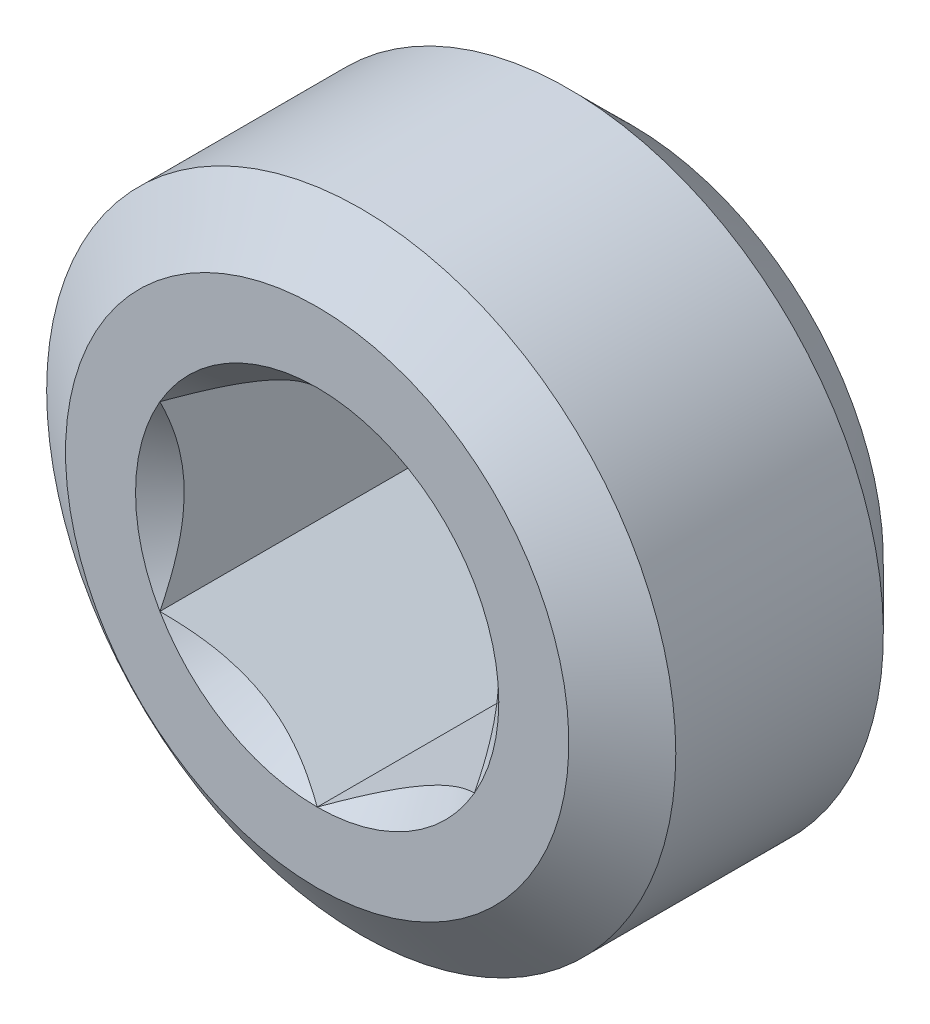
ISO-10303-21;
HEADER;
FILE_DESCRIPTION(('STEP AP214'),'2;1');
FILE_NAME('part.step','',(''),(''),'','','');
FILE_SCHEMA(('AUTOMOTIVE_DESIGN { 1 0 10303 214 1 1 1 1 }'));
ENDSEC;
DATA;
#1=APPLICATION_CONTEXT('core data for automotive mechanical design processes');
#2=APPLICATION_PROTOCOL_DEFINITION('international standard','automotive_design',2000,#1);
#3=PRODUCT_CONTEXT('',#1,'mechanical');
#4=PRODUCT('Part','Part','',(#3));
#5=PRODUCT_RELATED_PRODUCT_CATEGORY('part','',(#4));
#6=PRODUCT_DEFINITION_FORMATION('','',#4);
#7=PRODUCT_DEFINITION_CONTEXT('part definition',#1,'design');
#8=PRODUCT_DEFINITION('design','',#6,#7);
#9=PRODUCT_DEFINITION_SHAPE('','',#8);
#10=(LENGTH_UNIT() NAMED_UNIT(*) SI_UNIT(.MILLI.,.METRE.));
#11=(NAMED_UNIT(*) PLANE_ANGLE_UNIT() SI_UNIT($,.RADIAN.));
#12=(NAMED_UNIT(*) SI_UNIT($,.STERADIAN.) SOLID_ANGLE_UNIT());
#13=UNCERTAINTY_MEASURE_WITH_UNIT(LENGTH_MEASURE(1.E-05),#10,'distance_accuracy_value','');
#14=(GEOMETRIC_REPRESENTATION_CONTEXT(3) GLOBAL_UNCERTAINTY_ASSIGNED_CONTEXT((#13)) GLOBAL_UNIT_ASSIGNED_CONTEXT((#10,
#11,#12)) REPRESENTATION_CONTEXT('',''));
#15=CARTESIAN_POINT('',(0.,0.,0.));
#16=DIRECTION('',(0.,0.,1.));
#17=DIRECTION('',(1.,0.,0.));
#18=AXIS2_PLACEMENT_3D('',#15,#16,#17);
#19=CARTESIAN_POINT('',(-26.7001511278113,2.25730091694708,9.72285659624124));
#20=DIRECTION('',(0.5,-0.866025403784439,0.));
#21=DIRECTION('',(0.866025403784439,0.5,0.));
#22=AXIS2_PLACEMENT_3D('',#19,#20,#21);
#23=PLANE('',#22);
#24=CARTESIAN_POINT('',(-26.7001511278299,2.25730091693024,12.8978565962272));
#25=CARTESIAN_POINT('',(-26.6455879775564,2.28880296643238,12.8663847785851));
#26=CARTESIAN_POINT('',(-26.5901125302342,2.32083173087885,12.836761659007));
#27=CARTESIAN_POINT('',(-26.4769924001289,2.38614166844709,12.782522991681));
#28=CARTESIAN_POINT('',(-26.4193369654938,2.41942904915349,12.7579376124487));
#29=CARTESIAN_POINT('',(-26.3030776097173,2.48655141950653,12.7158226923412));
#30=CARTESIAN_POINT('',(-26.2445032803684,2.52036932432384,12.698187325774));
#31=CARTESIAN_POINT('',(-26.1260654656066,2.58874942855891,12.6710166849103));
#32=CARTESIAN_POINT('',(-26.0662055956986,2.62330954056393,12.6614611363602));
#33=CARTESIAN_POINT('',(-25.9630343536465,2.68287548493528,12.652839338127));
#34=CARTESIAN_POINT('',(-25.9198561754726,2.70780441772711,12.6515634180169));
#35=CARTESIAN_POINT('',(-25.8335704619126,2.75762149767819,12.6537157340965));
#36=CARTESIAN_POINT('',(-25.7904629565889,2.78250962748097,12.6571456191349));
#37=CARTESIAN_POINT('',(-25.7046659277156,2.83204456519659,12.6685129104493));
#38=CARTESIAN_POINT('',(-25.6619767983377,2.85669114553441,12.6764542164838));
#39=CARTESIAN_POINT('',(-25.5773150768888,2.90557061320299,12.6964128731102));
#40=CARTESIAN_POINT('',(-25.5353428003856,2.92980331834058,12.7084319725752));
#41=CARTESIAN_POINT('',(-25.4278758481489,2.99184939214346,12.7441004281705));
#42=CARTESIAN_POINT('',(-25.363046571638,3.02927859238842,12.7704343038184));
#43=CARTESIAN_POINT('',(-25.2677222434358,3.08431411893625,12.8148872108213));
#44=CARTESIAN_POINT('',(-25.2363099178139,3.10245003358992,12.8305049555352));
#45=CARTESIAN_POINT('',(-25.174062645343,3.13838851310735,12.8631660468058));
#46=CARTESIAN_POINT('',(-25.1432274322107,3.15619123170977,12.8802087150041));
#47=CARTESIAN_POINT('',(-25.1126511277906,3.17384446929754,12.8978565962298));
#48=B_SPLINE_CURVE_WITH_KNOTS('',3,(#24,#25,#26,#27,#28,#29,#30,#31,#32,#33,#34,#35,#36,#37,#38,
#39,#40,#41,#42,#43,#44,#45,#46,#47),.UNSPECIFIED.,.F.,.F.,(4,2,2,2,2,2,2,2,2,2,2,4),(0.,
0.211427927735293,0.424087197154886,0.633370156432808,0.842126401529719,0.991537201113437,
1.14100036553609,1.29059292578889,1.44024972416641,1.67781721418784,1.7962706941292,
1.91466809997211),.UNSPECIFIED.);
#49=CARTESIAN_POINT('',(-26.7001511278455,2.25730091691561,12.8978565962493));
#50=VERTEX_POINT('',#49);
#51=CARTESIAN_POINT('',(-25.1126511278011,3.17384446924024,12.8978565962493));
#52=VERTEX_POINT('',#51);
#53=EDGE_CURVE('E111',#50,#52,#48,.T.);
#54=ORIENTED_EDGE('',*,*,#53,.T.);
#55=DIRECTION('',(0.,0.,1.));
#56=VECTOR('',#55,1.);
#57=CARTESIAN_POINT('',(-25.1126511278113,3.17384446928561,9.72285659624124));
#58=LINE('',#57,#56);
#59=CARTESIAN_POINT('',(-25.1126511278113,3.17384446928561,9.72285659624124));
#60=VERTEX_POINT('',#59);
#61=EDGE_CURVE('E108',#52,#60,#58,.F.);
#62=ORIENTED_EDGE('',*,*,#61,.T.);
#63=DIRECTION('',(-0.866025403784439,-0.5,0.));
#64=VECTOR('',#63,1.);
#65=CARTESIAN_POINT('',(-25.1126511278113,3.17384446928561,9.72285659624124));
#66=LINE('',#65,#64);
#67=CARTESIAN_POINT('',(-26.7001511278113,2.25730091694708,9.72285659624124));
#68=VERTEX_POINT('',#67);
#69=EDGE_CURVE('E105',#60,#68,#66,.T.);
#70=ORIENTED_EDGE('',*,*,#69,.T.);
#71=DIRECTION('',(0.,0.,1.));
#72=VECTOR('',#71,1.);
#73=CARTESIAN_POINT('',(-26.7001511278113,2.25730091694708,9.72285659624124));
#74=LINE('',#73,#72);
#75=EDGE_CURVE('E373',#68,#50,#74,.T.);
#76=ORIENTED_EDGE('',*,*,#75,.T.);
#77=EDGE_LOOP('',(#54,#62,#70,#76));
#78=FACE_BOUND('',#77,.T.);
#79=ADVANCED_FACE('F36',(#78),#23,.F.);
#80=CARTESIAN_POINT('',(-28.2876511278113,3.17384446928562,9.72285659624124));
#81=DIRECTION('',(-0.5,-0.866025403784439,0.));
#82=DIRECTION('',(0.866025403784439,-0.5,0.));
#83=AXIS2_PLACEMENT_3D('',#80,#81,#82);
#84=PLANE('',#83);
#85=CARTESIAN_POINT('',(-28.2876511278352,3.17384446929334,12.8978565962272));
#86=CARTESIAN_POINT('',(-28.2330879775583,3.14234241979704,12.8663847785851));
#87=CARTESIAN_POINT('',(-28.1776125302347,3.11031365535297,12.836761659007));
#88=CARTESIAN_POINT('',(-28.0644924001284,3.0450037177865,12.782522991681));
#89=CARTESIAN_POINT('',(-28.0068369654937,3.01171633707944,12.7579376124487));
#90=CARTESIAN_POINT('',(-27.8905776097175,2.94459396672594,12.7158226923412));
#91=CARTESIAN_POINT('',(-27.8320032803684,2.91077606190879,12.698187325774));
#92=CARTESIAN_POINT('',(-27.7135654656065,2.84239595767385,12.6710166849103));
#93=CARTESIAN_POINT('',(-27.6537055956985,2.80783584566879,12.6614611363602));
#94=CARTESIAN_POINT('',(-27.5505343536465,2.74826990129741,12.652839338127));
#95=CARTESIAN_POINT('',(-27.5073561754726,2.72334096850558,12.6515634180169));
#96=CARTESIAN_POINT('',(-27.4210704619126,2.67352388855451,12.6537157340965));
#97=CARTESIAN_POINT('',(-27.3779629565888,2.64863575875173,12.6571456191349));
#98=CARTESIAN_POINT('',(-27.2921659277156,2.59910082103611,12.6685129104493));
#99=CARTESIAN_POINT('',(-27.2494767983377,2.57445424069829,12.6764542164838));
#100=CARTESIAN_POINT('',(-27.1648150768888,2.52557477302971,12.6964128731102));
#101=CARTESIAN_POINT('',(-27.1228428003857,2.50134206789212,12.7084319725752));
#102=CARTESIAN_POINT('',(-27.0153758481489,2.43929599408924,12.7441004281705));
#103=CARTESIAN_POINT('',(-26.950546571638,2.40186679384428,12.7704343038184));
#104=CARTESIAN_POINT('',(-26.8552222434358,2.34683126729645,12.8148872108213));
#105=CARTESIAN_POINT('',(-26.8238099178139,2.32869535264278,12.8305049555352));
#106=CARTESIAN_POINT('',(-26.761562645343,2.29275687312535,12.8631660468058));
#107=CARTESIAN_POINT('',(-26.7307274322107,2.27495415452293,12.8802087150041));
#108=CARTESIAN_POINT('',(-26.7001511277906,2.25730091693516,12.8978565962298));
#109=B_SPLINE_CURVE_WITH_KNOTS('',3,(#85,#86,#87,#88,#89,#90,#91,#92,#93,#94,#95,#96,#97,#98,
#99,#100,#101,#102,#103,#104,#105,#106,#107,#108),.UNSPECIFIED.,.F.,.F.,(4,2,2,2,2,2,2,2,2,2,2,
4),(0.,0.211427927735296,0.42408719715489,0.63337015643282,0.842126401529722,0.99153720111344,
1.14100036553609,1.29059292578889,1.44024972416641,1.67781721418783,1.7962706941292,
1.91466809997211),.UNSPECIFIED.);
#110=CARTESIAN_POINT('',(-28.2876511278556,3.17384446929952,12.8978565962493));
#111=VERTEX_POINT('',#110);
#112=EDGE_CURVE('E257',#111,#50,#109,.T.);
#113=ORIENTED_EDGE('',*,*,#112,.T.);
#114=ORIENTED_EDGE('',*,*,#75,.F.);
#115=DIRECTION('',(-0.866025403784439,0.5,0.));
#116=VECTOR('',#115,1.);
#117=CARTESIAN_POINT('',(-26.7001511278113,2.25730091694708,9.72285659624124));
#118=LINE('',#117,#116);
#119=CARTESIAN_POINT('',(-28.2876511278113,3.17384446928562,9.72285659624124));
#120=VERTEX_POINT('',#119);
#121=EDGE_CURVE('E99',#68,#120,#118,.T.);
#122=ORIENTED_EDGE('',*,*,#121,.T.);
#123=DIRECTION('',(0.,0.,1.));
#124=VECTOR('',#123,1.);
#125=CARTESIAN_POINT('',(-28.2876511278113,3.17384446928562,9.72285659624124));
#126=LINE('',#125,#124);
#127=EDGE_CURVE('E374',#120,#111,#126,.T.);
#128=ORIENTED_EDGE('',*,*,#127,.T.);
#129=EDGE_LOOP('',(#113,#114,#122,#128));
#130=FACE_BOUND('',#129,.T.);
#131=ADVANCED_FACE('F262',(#130),#84,.F.);
#132=CARTESIAN_POINT('',(-28.2876511278113,5.00693157396268,9.72285659624124));
#133=DIRECTION('',(-1.,0.,0.));
#134=DIRECTION('',(0.,0.,1.));
#135=AXIS2_PLACEMENT_3D('',#132,#133,#134);
#136=PLANE('',#135);
#137=CARTESIAN_POINT('',(-28.2876511278165,5.00693157398725,12.8978565962272));
#138=CARTESIAN_POINT('',(-28.2876511278132,4.9439274749888,12.8663847785851));
#139=CARTESIAN_POINT('',(-28.2876511278118,4.87986994609824,12.836761659007));
#140=CARTESIAN_POINT('',(-28.2876511278108,4.74925007096351,12.782522991681));
#141=CARTESIAN_POINT('',(-28.2876511278111,4.68267530955003,12.7579376124487));
#142=CARTESIAN_POINT('',(-28.2876511278114,4.54843056884348,12.7158226923413));
#143=CARTESIAN_POINT('',(-28.2876511278113,4.480794759209,12.698187325774));
#144=CARTESIAN_POINT('',(-28.2876511278112,4.34403455073897,12.6710166849104));
#145=CARTESIAN_POINT('',(-28.2876511278113,4.27491432672887,12.6614611363602));
#146=CARTESIAN_POINT('',(-28.2876511278113,4.15578243798612,12.652839338127));
#147=CARTESIAN_POINT('',(-28.2876511278113,4.10592457240245,12.651563418017));
#148=CARTESIAN_POINT('',(-28.2876511278113,4.00629041250027,12.6537157340966));
#149=CARTESIAN_POINT('',(-28.2876511278113,3.9565141528947,12.6571456191349));
#150=CARTESIAN_POINT('',(-28.2876511278113,3.85744427746342,12.6685129104494));
#151=CARTESIAN_POINT('',(-28.2876511278113,3.80815111678777,12.6764542164839));
#152=CARTESIAN_POINT('',(-28.2876511278113,3.71039218145058,12.6964128731103));
#153=CARTESIAN_POINT('',(-28.2876511278113,3.66192677117539,12.7084319725753));
#154=CARTESIAN_POINT('',(-28.2876511278113,3.53783462356968,12.7441004281706));
#155=CARTESIAN_POINT('',(-28.2876511278113,3.46297622307981,12.7704343038185));
#156=CARTESIAN_POINT('',(-28.2876511278113,3.35290516998421,12.8148872108214));
#157=CARTESIAN_POINT('',(-28.2876511278113,3.31663334067692,12.8305049555353));
#158=CARTESIAN_POINT('',(-28.2876511278113,3.24475638164209,12.8631660468058));
#159=CARTESIAN_POINT('',(-28.2876511278113,3.20915094443728,12.8802087150042));
#160=CARTESIAN_POINT('',(-28.2876511278113,3.17384446926177,12.8978565962298));
#161=B_SPLINE_CURVE_WITH_KNOTS('',3,(#137,#138,#139,#140,#141,#142,#143,#144,#145,#146,#147,
#148,#149,#150,#151,#152,#153,#154,#155,#156,#157,#158,#159,#160),.UNSPECIFIED.,.F.,.F.,(4,2,2,
2,2,2,2,2,2,2,2,4),(0.,0.211427927735331,0.424087197154954,0.633370156432907,0.842126401529846,
0.991537201113611,1.14100036553631,1.29059292578915,1.44024972416672,1.67781721418797,
1.79627069412926,1.91466809997208),.UNSPECIFIED.);
#162=CARTESIAN_POINT('',(-28.2876511278334,5.00693157397549,12.8978565962435));
#163=VERTEX_POINT('',#162);
#164=EDGE_CURVE('E40',#163,#111,#161,.T.);
#165=ORIENTED_EDGE('',*,*,#164,.T.);
#166=ORIENTED_EDGE('',*,*,#127,.F.);
#167=DIRECTION('',(0.,-1.,0.));
#168=VECTOR('',#167,1.);
#169=CARTESIAN_POINT('',(-28.2876511278113,6.63038802162415,9.72285659624124));
#170=LINE('',#169,#168);
#171=CARTESIAN_POINT('',(-28.2876511278113,5.00693157396268,9.72285659624124));
#172=VERTEX_POINT('',#171);
#173=EDGE_CURVE('E127',#120,#172,#170,.F.);
#174=ORIENTED_EDGE('',*,*,#173,.T.);
#175=DIRECTION('',(0.,0.,1.));
#176=VECTOR('',#175,1.);
#177=CARTESIAN_POINT('',(-28.2876511278113,5.00693157396268,9.72285659624124));
#178=LINE('',#177,#176);
#179=EDGE_CURVE('E80',#172,#163,#178,.T.);
#180=ORIENTED_EDGE('',*,*,#179,.T.);
#181=EDGE_LOOP('',(#165,#166,#174,#180));
#182=FACE_BOUND('',#181,.T.);
#183=ADVANCED_FACE('F221',(#182),#136,.F.);
#184=CARTESIAN_POINT('',(-26.7001511278113,5.92347512630121,9.72285659624124));
#185=DIRECTION('',(-0.5,0.866025403784439,0.));
#186=DIRECTION('',(-0.866025403784439,-0.5,0.));
#187=AXIS2_PLACEMENT_3D('',#184,#185,#186);
#188=PLANE('',#187);
#189=CARTESIAN_POINT('',(-26.7001511277926,5.92347512631805,12.8978565962272));
#190=CARTESIAN_POINT('',(-26.7547142780661,5.89197307681591,12.8663847785851));
#191=CARTESIAN_POINT('',(-26.8101897253883,5.85994431236944,12.836761659007));
#192=CARTESIAN_POINT('',(-26.9233098554936,5.79463437480121,12.782522991681));
#193=CARTESIAN_POINT('',(-26.9809652901287,5.7613469940948,12.7579376124487));
#194=CARTESIAN_POINT('',(-27.0972246459052,5.69422462374177,12.7158226923412));
#195=CARTESIAN_POINT('',(-27.1557989752541,5.66040671892445,12.698187325774));
#196=CARTESIAN_POINT('',(-27.274236790016,5.59202661468938,12.6710166849103));
#197=CARTESIAN_POINT('',(-27.334096659924,5.55746650268437,12.6614611363602));
#198=CARTESIAN_POINT('',(-27.437267901976,5.49790055831301,12.652839338127));
#199=CARTESIAN_POINT('',(-27.4804460801499,5.47297162552118,12.6515634180169));
#200=CARTESIAN_POINT('',(-27.5667317937099,5.4231545455701,12.6537157340965));
#201=CARTESIAN_POINT('',(-27.6098392990337,5.39826641576733,12.6571456191349));
#202=CARTESIAN_POINT('',(-27.6956363279069,5.3487314780517,12.6685129104493));
#203=CARTESIAN_POINT('',(-27.7383254572848,5.32408489771388,12.6764542164838));
#204=CARTESIAN_POINT('',(-27.8229871787337,5.2752054300453,12.6964128731102));
#205=CARTESIAN_POINT('',(-27.8649594552369,5.25097272490771,12.7084319725752));
#206=CARTESIAN_POINT('',(-27.9724264074736,5.18892665110484,12.7441004281705));
#207=CARTESIAN_POINT('',(-28.0372556839846,5.15149745085987,12.7704343038184));
#208=CARTESIAN_POINT('',(-28.1325800121867,5.09646192431204,12.8148872108213));
#209=CARTESIAN_POINT('',(-28.1639923378086,5.07832600965838,12.8305049555352));
#210=CARTESIAN_POINT('',(-28.2262396102796,5.04238753014094,12.8631660468058));
#211=CARTESIAN_POINT('',(-28.2570748234118,5.02458481153852,12.8802087150041));
#212=CARTESIAN_POINT('',(-28.2876511278319,5.00693157395076,12.8978565962298));
#213=B_SPLINE_CURVE_WITH_KNOTS('',3,(#189,#190,#191,#192,#193,#194,#195,#196,#197,#198,#199,
#200,#201,#202,#203,#204,#205,#206,#207,#208,#209,#210,#211,#212),.UNSPECIFIED.,.F.,.F.,(4,2,2,
2,2,2,2,2,2,2,2,4),(0.,0.211427927735295,0.424087197154886,0.633370156432807,0.842126401529718,
0.991537201113436,1.14100036553609,1.29059292578889,1.44024972416641,1.67781721418784,
1.7962706941292,1.91466809997211),.UNSPECIFIED.);
#214=CARTESIAN_POINT('',(-26.700151127777,5.92347512633268,12.8978565962493));
#215=VERTEX_POINT('',#214);
#216=EDGE_CURVE('E125',#215,#163,#213,.T.);
#217=ORIENTED_EDGE('',*,*,#216,.T.);
#218=ORIENTED_EDGE('',*,*,#179,.F.);
#219=DIRECTION('',(0.866025403784439,0.5,0.));
#220=VECTOR('',#219,1.);
#221=CARTESIAN_POINT('',(-28.2876511278113,5.00693157396268,9.72285659624124));
#222=LINE('',#221,#220);
#223=CARTESIAN_POINT('',(-26.7001511278113,5.92347512630121,9.72285659624124));
#224=VERTEX_POINT('',#223);
#225=EDGE_CURVE('E137',#172,#224,#222,.T.);
#226=ORIENTED_EDGE('',*,*,#225,.T.);
#227=DIRECTION('',(0.,0.,1.));
#228=VECTOR('',#227,1.);
#229=CARTESIAN_POINT('',(-26.7001511278113,5.92347512630121,9.72285659624124));
#230=LINE('',#229,#228);
#231=EDGE_CURVE('E60',#224,#215,#230,.T.);
#232=ORIENTED_EDGE('',*,*,#231,.T.);
#233=EDGE_LOOP('',(#217,#218,#226,#232));
#234=FACE_BOUND('',#233,.T.);
#235=ADVANCED_FACE('F181',(#234),#188,.F.);
#236=CARTESIAN_POINT('',(-25.1126511278113,5.00693157396268,9.72285659624124));
#237=DIRECTION('',(0.5,0.866025403784439,0.));
#238=DIRECTION('',(-0.866025403784439,0.5,0.));
#239=AXIS2_PLACEMENT_3D('',#236,#237,#238);
#240=PLANE('',#239);
#241=CARTESIAN_POINT('',(-25.1126511277874,5.00693157395495,12.8978565962272));
#242=CARTESIAN_POINT('',(-25.1672142780642,5.03843362345125,12.8663847785851));
#243=CARTESIAN_POINT('',(-25.2226897253878,5.07046238789532,12.836761659007));
#244=CARTESIAN_POINT('',(-25.3358098554941,5.13577232546179,12.782522991681));
#245=CARTESIAN_POINT('',(-25.3934652901289,5.16905970616885,12.7579376124487));
#246=CARTESIAN_POINT('',(-25.5097246459051,5.23618207652235,12.7158226923412));
#247=CARTESIAN_POINT('',(-25.5682989752541,5.2699999813395,12.698187325774));
#248=CARTESIAN_POINT('',(-25.686736790016,5.33838008557444,12.6710166849103));
#249=CARTESIAN_POINT('',(-25.746596659924,5.37294019757951,12.6614611363602));
#250=CARTESIAN_POINT('',(-25.849767901976,5.43250614195088,12.652839338127));
#251=CARTESIAN_POINT('',(-25.8929460801499,5.45743507474271,12.6515634180169));
#252=CARTESIAN_POINT('',(-25.9792317937099,5.50725215469378,12.6537157340965));
#253=CARTESIAN_POINT('',(-26.0223392990337,5.53214028449656,12.6571456191349));
#254=CARTESIAN_POINT('',(-26.1081363279069,5.58167522221219,12.6685129104493));
#255=CARTESIAN_POINT('',(-26.1508254572848,5.60632180255,12.6764542164838));
#256=CARTESIAN_POINT('',(-26.2354871787337,5.65520127021859,12.6964128731102));
#257=CARTESIAN_POINT('',(-26.2774594552369,5.67943397535617,12.7084319725752));
#258=CARTESIAN_POINT('',(-26.3849264074736,5.74148004915905,12.7441004281705));
#259=CARTESIAN_POINT('',(-26.4497556839846,5.77890924940401,12.7704343038184));
#260=CARTESIAN_POINT('',(-26.5450800121867,5.83394477595185,12.8148872108213));
#261=CARTESIAN_POINT('',(-26.5764923378086,5.85208069060551,12.8305049555352));
#262=CARTESIAN_POINT('',(-26.6387396102796,5.88801917012294,12.8631660468058));
#263=CARTESIAN_POINT('',(-26.6695748234118,5.90582188872536,12.8802087150041));
#264=CARTESIAN_POINT('',(-26.7001511278319,5.92347512631313,12.8978565962298));
#265=B_SPLINE_CURVE_WITH_KNOTS('',3,(#241,#242,#243,#244,#245,#246,#247,#248,#249,#250,#251,
#252,#253,#254,#255,#256,#257,#258,#259,#260,#261,#262,#263,#264),.UNSPECIFIED.,.F.,.F.,(4,2,2,
2,2,2,2,2,2,2,2,4),(0.,0.211427927735295,0.424087197154889,0.633370156432807,0.842126401529718,
0.99153720111344,1.14100036553609,1.29059292578889,1.44024972416641,1.67781721418784,
1.79627069412921,1.91466809997211),.UNSPECIFIED.);
#266=CARTESIAN_POINT('',(-25.1126511277669,5.00693157394877,12.8978565962493));
#267=VERTEX_POINT('',#266);
#268=EDGE_CURVE('E129',#267,#215,#265,.T.);
#269=ORIENTED_EDGE('',*,*,#268,.T.);
#270=ORIENTED_EDGE('',*,*,#231,.F.);
#271=DIRECTION('',(0.866025403784439,-0.5,0.));
#272=VECTOR('',#271,1.);
#273=CARTESIAN_POINT('',(-26.7001511278113,5.92347512630121,9.72285659624124));
#274=LINE('',#273,#272);
#275=CARTESIAN_POINT('',(-25.1126511278113,5.00693157396268,9.72285659624124));
#276=VERTEX_POINT('',#275);
#277=EDGE_CURVE('E87',#224,#276,#274,.T.);
#278=ORIENTED_EDGE('',*,*,#277,.T.);
#279=DIRECTION('',(0.,0.,1.));
#280=VECTOR('',#279,1.);
#281=CARTESIAN_POINT('',(-25.1126511278113,5.00693157396268,9.72285659624124));
#282=LINE('',#281,#280);
#283=EDGE_CURVE('E115',#276,#267,#282,.T.);
#284=ORIENTED_EDGE('',*,*,#283,.T.);
#285=EDGE_LOOP('',(#269,#270,#278,#284));
#286=FACE_BOUND('',#285,.T.);
#287=ADVANCED_FACE('F214',(#286),#240,.F.);
#288=CARTESIAN_POINT('',(-25.1126511278113,3.17384446928561,9.72285659624124));
#289=DIRECTION('',(1.,0.,0.));
#290=DIRECTION('',(0.,1.,0.));
#291=AXIS2_PLACEMENT_3D('',#288,#289,#290);
#292=PLANE('',#291);
#293=ORIENTED_EDGE('',*,*,#61,.F.);
#294=CARTESIAN_POINT('',(-25.112651127806,3.17384446926104,12.8978565962272));
#295=CARTESIAN_POINT('',(-25.1126511278094,3.23643697886376,12.8665895431637));
#296=CARTESIAN_POINT('',(-25.1126511278108,3.30006936643204,12.8371481777406));
#297=CARTESIAN_POINT('',(-25.1126511278118,3.42984638795901,12.7831815602623));
#298=CARTESIAN_POINT('',(-25.1126511278114,3.49600451554905,12.7586890447444));
#299=CARTESIAN_POINT('',(-25.1126511278111,3.6302328539093,12.7163957345132));
#300=CARTESIAN_POINT('',(-25.1126511278112,3.69829573425156,12.6985722928907));
#301=CARTESIAN_POINT('',(-25.1126511278113,3.8359135486243,12.6711323340109));
#302=CARTESIAN_POINT('',(-25.1126511278113,3.90546317753883,12.661490438062));
#303=CARTESIAN_POINT('',(-25.1126511278113,3.99445320432207,12.655049478333));
#304=CARTESIAN_POINT('',(-25.1126511278113,4.01363054610579,12.6540081766806));
#305=CARTESIAN_POINT('',(-25.1126511278113,4.05200037003385,12.6526180572564));
#306=CARTESIAN_POINT('',(-25.1126511278113,4.07119283827833,12.6522688633069));
#307=CARTESIAN_POINT('',(-25.1126511278113,4.13856415901281,12.6522710682843));
#308=CARTESIAN_POINT('',(-25.1126511278113,4.18675739913264,12.654476214616));
#309=CARTESIAN_POINT('',(-25.1126511278113,4.28276799838381,12.663165837215));
#310=CARTESIAN_POINT('',(-25.1126511278113,4.3305850717913,12.6696532982124));
#311=CARTESIAN_POINT('',(-25.1126511278113,4.47339902380451,12.6951335797866));
#312=CARTESIAN_POINT('',(-25.1126511278113,4.56735508469579,12.7201399771013));
#313=CARTESIAN_POINT('',(-25.1126511278113,4.7191252115014,12.7712966249484));
#314=CARTESIAN_POINT('',(-25.1126511278113,4.77817570945922,12.7940442583679));
#315=CARTESIAN_POINT('',(-25.1126511278113,4.89404078575268,12.8433457194467));
#316=CARTESIAN_POINT('',(-25.1126511278113,4.95087087487067,12.8698628306548));
#317=CARTESIAN_POINT('',(-25.1126511278113,5.00693157398641,12.8978565962297));
#318=B_SPLINE_CURVE_WITH_KNOTS('',3,(#294,#295,#296,#297,#298,#299,#300,#301,#302,#303,#304,
#305,#306,#307,#308,#309,#310,#311,#312,#313,#314,#315,#316,#317),.UNSPECIFIED.,.F.,.F.,(4,2,2,
2,2,2,2,2,2,2,2,4),(0.,0.210047204141744,0.421441388622221,0.632111059453722,0.842124830801237,
0.899732953419875,0.957309756011443,1.10181621380756,1.24642349764664,1.53683268064683,
1.72655304072025,1.91453812066735),.UNSPECIFIED.);
#319=EDGE_CURVE('E202',#52,#267,#318,.T.);
#320=ORIENTED_EDGE('',*,*,#319,.T.);
#321=ORIENTED_EDGE('',*,*,#283,.F.);
#322=DIRECTION('',(0.,-1.,0.));
#323=VECTOR('',#322,1.);
#324=CARTESIAN_POINT('',(-25.1126511278113,6.63038802162415,9.72285659624124));
#325=LINE('',#324,#323);
#326=EDGE_CURVE('E118',#276,#60,#325,.T.);
#327=ORIENTED_EDGE('',*,*,#326,.T.);
#328=EDGE_LOOP('',(#293,#320,#321,#327));
#329=FACE_BOUND('',#328,.T.);
#330=ADVANCED_FACE('F119',(#329),#292,.F.);
#331=CARTESIAN_POINT('',(-26.7001511278113,4.09038802162415,12.8978565962691));
#332=DIRECTION('',(0.,0.,1.));
#333=DIRECTION('',(1.,0.,0.));
#334=AXIS2_PLACEMENT_3D('',#331,#332,#333);
#335=CONICAL_SURFACE('',#334,1.83308710472829,0.785398163512482);
#336=ORIENTED_EDGE('',*,*,#164,.F.);
#337=CARTESIAN_POINT('',(-26.7001511278113,4.09038802162415,12.8978565962691));
#338=DIRECTION('',(0.,0.,1.));
#339=DIRECTION('',(1.,0.,0.));
#340=AXIS2_PLACEMENT_3D('',#337,#338,#339);
#341=CIRCLE('',#340,1.83308710472829);
#342=EDGE_CURVE('E121',#163,#111,#341,.T.);
#343=ORIENTED_EDGE('',*,*,#342,.T.);
#344=EDGE_LOOP('',(#336,#343));
#345=FACE_BOUND('',#344,.T.);
#346=ADVANCED_FACE('F213',(#345),#335,.F.);
#347=CARTESIAN_POINT('',(-26.7001511278113,4.09038802162415,12.8978565962691));
#348=DIRECTION('',(0.,0.,1.));
#349=DIRECTION('',(1.,0.,0.));
#350=AXIS2_PLACEMENT_3D('',#347,#348,#349);
#351=CONICAL_SURFACE('',#350,1.83308710472829,0.78539816351237);
#352=ORIENTED_EDGE('',*,*,#112,.F.);
#353=CARTESIAN_POINT('',(-26.7001511278113,4.09038802162415,12.8978565962691));
#354=DIRECTION('',(0.,0.,1.));
#355=DIRECTION('',(1.,0.,0.));
#356=AXIS2_PLACEMENT_3D('',#353,#354,#355);
#357=CIRCLE('',#356,1.83308710472829);
#358=EDGE_CURVE('E165',#111,#50,#357,.T.);
#359=ORIENTED_EDGE('',*,*,#358,.T.);
#360=EDGE_LOOP('',(#352,#359));
#361=FACE_BOUND('',#360,.T.);
#362=ADVANCED_FACE('F264',(#361),#351,.F.);
#363=CARTESIAN_POINT('',(-26.7001511278113,4.09038802162415,12.8978565962691));
#364=DIRECTION('',(0.,0.,1.));
#365=DIRECTION('',(1.,0.,0.));
#366=AXIS2_PLACEMENT_3D('',#363,#364,#365);
#367=CONICAL_SURFACE('',#366,1.83308710472829,0.78539816351237);
#368=ORIENTED_EDGE('',*,*,#53,.F.);
#369=CARTESIAN_POINT('',(-26.7001511278113,4.09038802162415,12.8978565962691));
#370=DIRECTION('',(0.,0.,1.));
#371=DIRECTION('',(1.,0.,0.));
#372=AXIS2_PLACEMENT_3D('',#369,#370,#371);
#373=CIRCLE('',#372,1.83308710472829);
#374=EDGE_CURVE('E163',#50,#52,#373,.T.);
#375=ORIENTED_EDGE('',*,*,#374,.T.);
#376=EDGE_LOOP('',(#368,#375));
#377=FACE_BOUND('',#376,.T.);
#378=ADVANCED_FACE('F198',(#377),#367,.F.);
#379=CARTESIAN_POINT('',(-26.7001511278113,4.09038802162415,12.8978565962691));
#380=DIRECTION('',(0.,0.,1.));
#381=DIRECTION('',(1.,0.,0.));
#382=AXIS2_PLACEMENT_3D('',#379,#380,#381);
#383=CONICAL_SURFACE('',#382,1.83308710472829,0.785398163397448);
#384=ORIENTED_EDGE('',*,*,#319,.F.);
#385=CARTESIAN_POINT('',(-26.7001511278113,4.09038802162415,12.8978565962691));
#386=DIRECTION('',(0.,0.,1.));
#387=DIRECTION('',(1.,0.,0.));
#388=AXIS2_PLACEMENT_3D('',#385,#386,#387);
#389=CIRCLE('',#388,1.83308710472829);
#390=EDGE_CURVE('E160',#52,#267,#389,.T.);
#391=ORIENTED_EDGE('',*,*,#390,.T.);
#392=EDGE_LOOP('',(#384,#391));
#393=FACE_BOUND('',#392,.T.);
#394=ADVANCED_FACE('F193',(#393),#383,.F.);
#395=CARTESIAN_POINT('',(-26.7001511278113,4.09038802162415,12.8978565962691));
#396=DIRECTION('',(0.,0.,1.));
#397=DIRECTION('',(1.,0.,0.));
#398=AXIS2_PLACEMENT_3D('',#395,#396,#397);
#399=CONICAL_SURFACE('',#398,1.83308710472829,0.78539816351237);
#400=ORIENTED_EDGE('',*,*,#268,.F.);
#401=CARTESIAN_POINT('',(-26.7001511278113,4.09038802162415,12.8978565962691));
#402=DIRECTION('',(0.,0.,1.));
#403=DIRECTION('',(1.,0.,0.));
#404=AXIS2_PLACEMENT_3D('',#401,#402,#403);
#405=CIRCLE('',#404,1.83308710472829);
#406=EDGE_CURVE('E157',#267,#215,#405,.T.);
#407=ORIENTED_EDGE('',*,*,#406,.T.);
#408=EDGE_LOOP('',(#400,#407));
#409=FACE_BOUND('',#408,.T.);
#410=ADVANCED_FACE('F187',(#409),#399,.F.);
#411=CARTESIAN_POINT('',(-26.7001511278113,4.09038802162415,12.8978565962691));
#412=DIRECTION('',(0.,0.,1.));
#413=DIRECTION('',(1.,0.,0.));
#414=AXIS2_PLACEMENT_3D('',#411,#412,#413);
#415=CONICAL_SURFACE('',#414,1.83308710472829,0.78539816351237);
#416=ORIENTED_EDGE('',*,*,#216,.F.);
#417=CARTESIAN_POINT('',(-26.7001511278113,4.09038802162415,12.8978565962691));
#418=DIRECTION('',(0.,0.,1.));
#419=DIRECTION('',(1.,0.,0.));
#420=AXIS2_PLACEMENT_3D('',#417,#418,#419);
#421=CIRCLE('',#420,1.83308710472829);
#422=EDGE_CURVE('E154',#215,#163,#421,.T.);
#423=ORIENTED_EDGE('',*,*,#422,.T.);
#424=EDGE_LOOP('',(#416,#423));
#425=FACE_BOUND('',#424,.T.);
#426=ADVANCED_FACE('F183',(#425),#415,.F.);
#427=CARTESIAN_POINT('',(-26.7001511278113,6.63038802162415,9.72285659624124));
#428=DIRECTION('',(0.,0.,1.));
#429=DIRECTION('',(0.,-1.,0.));
#430=AXIS2_PLACEMENT_3D('',#427,#428,#429);
#431=PLANE('',#430);
#432=CARTESIAN_POINT('',(-26.7001511278113,4.09038802162415,9.72285659621341));
#433=DIRECTION('',(0.,0.,1.));
#434=DIRECTION('',(0.,-1.,0.));
#435=AXIS2_PLACEMENT_3D('',#432,#433,#434);
#436=CIRCLE('',#435,2.54000000006727);
#437=CARTESIAN_POINT('',(-26.7001511278113,1.55038802155688,9.72285659621341));
#438=VERTEX_POINT('',#437);
#439=EDGE_CURVE('E151',#438,#438,#436,.T.);
#440=ORIENTED_EDGE('',*,*,#439,.F.);
#441=EDGE_LOOP('',(#440));
#442=FACE_BOUND('',#441,.T.);
#443=ORIENTED_EDGE('',*,*,#277,.F.);
#444=ORIENTED_EDGE('',*,*,#225,.F.);
#445=ORIENTED_EDGE('',*,*,#173,.F.);
#446=ORIENTED_EDGE('',*,*,#121,.F.);
#447=ORIENTED_EDGE('',*,*,#69,.F.);
#448=ORIENTED_EDGE('',*,*,#326,.F.);
#449=EDGE_LOOP('',(#443,#444,#445,#446,#447,#448));
#450=FACE_BOUND('',#449,.T.);
#451=ADVANCED_FACE('F123',(#442,#450),#431,.F.);
#452=CARTESIAN_POINT('',(-26.7001511278113,4.09038802162415,12.8978565962412));
#453=DIRECTION('',(0.,0.,-1.));
#454=DIRECTION('',(0.,1.,0.));
#455=AXIS2_PLACEMENT_3D('',#452,#453,#454);
#456=PLANE('',#455);
#457=CARTESIAN_POINT('',(-26.7001511278113,4.09038802162415,12.8978565962861));
#458=DIRECTION('',(0.,0.,-1.));
#459=DIRECTION('',(0.,1.,0.));
#460=AXIS2_PLACEMENT_3D('',#457,#458,#459);
#461=CIRCLE('',#460,2.54000000001042);
#462=CARTESIAN_POINT('',(-26.7001511278113,6.63038802163457,12.8978565962861));
#463=VERTEX_POINT('',#462);
#464=EDGE_CURVE('E148',#463,#463,#461,.T.);
#465=ORIENTED_EDGE('',*,*,#464,.F.);
#466=EDGE_LOOP('',(#465));
#467=FACE_BOUND('',#466,.T.);
#468=ORIENTED_EDGE('',*,*,#406,.F.);
#469=ORIENTED_EDGE('',*,*,#390,.F.);
#470=ORIENTED_EDGE('',*,*,#374,.F.);
#471=ORIENTED_EDGE('',*,*,#358,.F.);
#472=ORIENTED_EDGE('',*,*,#342,.F.);
#473=ORIENTED_EDGE('',*,*,#422,.F.);
#474=EDGE_LOOP('',(#468,#469,#470,#471,#472,#473));
#475=FACE_BOUND('',#474,.T.);
#476=ADVANCED_FACE('F236',(#467,#475),#456,.F.);
#477=CARTESIAN_POINT('',(-26.7001511278113,4.09038802162415,10.3578565962018));
#478=DIRECTION('',(0.,0.,1.));
#479=DIRECTION('',(0.,-1.,0.));
#480=AXIS2_PLACEMENT_3D('',#477,#478,#479);
#481=CONICAL_SURFACE('',#480,3.17499999999882,0.78539816335269);
#482=CARTESIAN_POINT('',(-26.7001511278113,4.09038802162415,10.3578565962412));
#483=DIRECTION('',(0.,0.,1.));
#484=DIRECTION('',(0.,-1.,0.));
#485=AXIS2_PLACEMENT_3D('',#482,#483,#484);
#486=CIRCLE('',#485,3.175);
#487=CARTESIAN_POINT('',(-26.7001511278113,0.915388021624147,10.3578565962412));
#488=VERTEX_POINT('',#487);
#489=EDGE_CURVE('E51',#488,#488,#486,.T.);
#490=ORIENTED_EDGE('',*,*,#489,.F.);
#491=EDGE_LOOP('',(#490));
#492=FACE_BOUND('',#491,.T.);
#493=ORIENTED_EDGE('',*,*,#439,.T.);
#494=EDGE_LOOP('',(#493));
#495=FACE_BOUND('',#494,.T.);
#496=ADVANCED_FACE('F230',(#492,#495),#481,.T.);
#497=CARTESIAN_POINT('',(-26.7001511278113,4.09038802162415,12.4532248095058));
#498=DIRECTION('',(0.,0.,-1.));
#499=DIRECTION('',(0.,1.,0.));
#500=AXIS2_PLACEMENT_3D('',#497,#498,#499);
#501=CONICAL_SURFACE('',#500,3.17499999994197,0.95993108852815);
#502=CARTESIAN_POINT('',(-26.7001511278113,4.09038802162415,12.4532248094781));
#503=DIRECTION('',(0.,0.,1.));
#504=DIRECTION('',(0.,-1.,0.));
#505=AXIS2_PLACEMENT_3D('',#502,#503,#504);
#506=CIRCLE('',#505,3.175);
#507=CARTESIAN_POINT('',(-26.7001511278113,0.915388021624147,12.4532248094781));
#508=VERTEX_POINT('',#507);
#509=EDGE_CURVE('E11',#508,#508,#506,.F.);
#510=ORIENTED_EDGE('',*,*,#509,.F.);
#511=EDGE_LOOP('',(#510));
#512=FACE_BOUND('',#511,.T.);
#513=ORIENTED_EDGE('',*,*,#464,.T.);
#514=EDGE_LOOP('',(#513));
#515=FACE_BOUND('',#514,.T.);
#516=ADVANCED_FACE('F224',(#512,#515),#501,.T.);
#517=CARTESIAN_POINT('',(-26.7001511278113,4.09038802162415,11.3103565962412));
#518=DIRECTION('',(0.,0.,1.));
#519=DIRECTION('',(0.,-1.,0.));
#520=AXIS2_PLACEMENT_3D('',#517,#518,#519);
#521=CYLINDRICAL_SURFACE('',#520,3.175);
#522=ORIENTED_EDGE('',*,*,#509,.T.);
#523=EDGE_LOOP('',(#522));
#524=FACE_BOUND('',#523,.T.);
#525=ORIENTED_EDGE('',*,*,#489,.T.);
#526=EDGE_LOOP('',(#525));
#527=FACE_BOUND('',#526,.T.);
#528=ADVANCED_FACE('F222',(#524,#527),#521,.T.);
#529=CLOSED_SHELL('',(#79,#131,#183,#235,#287,#330,#346,#362,#378,#394,#410,#426,#451,#476,#496,
#516,#528));
#530=MANIFOLD_SOLID_BREP('B2',#529);
#531=ADVANCED_BREP_SHAPE_REPRESENTATION('',(#18,#530),#14);
#532=SHAPE_DEFINITION_REPRESENTATION(#9,#531);
ENDSEC;
END-ISO-10303-21;
